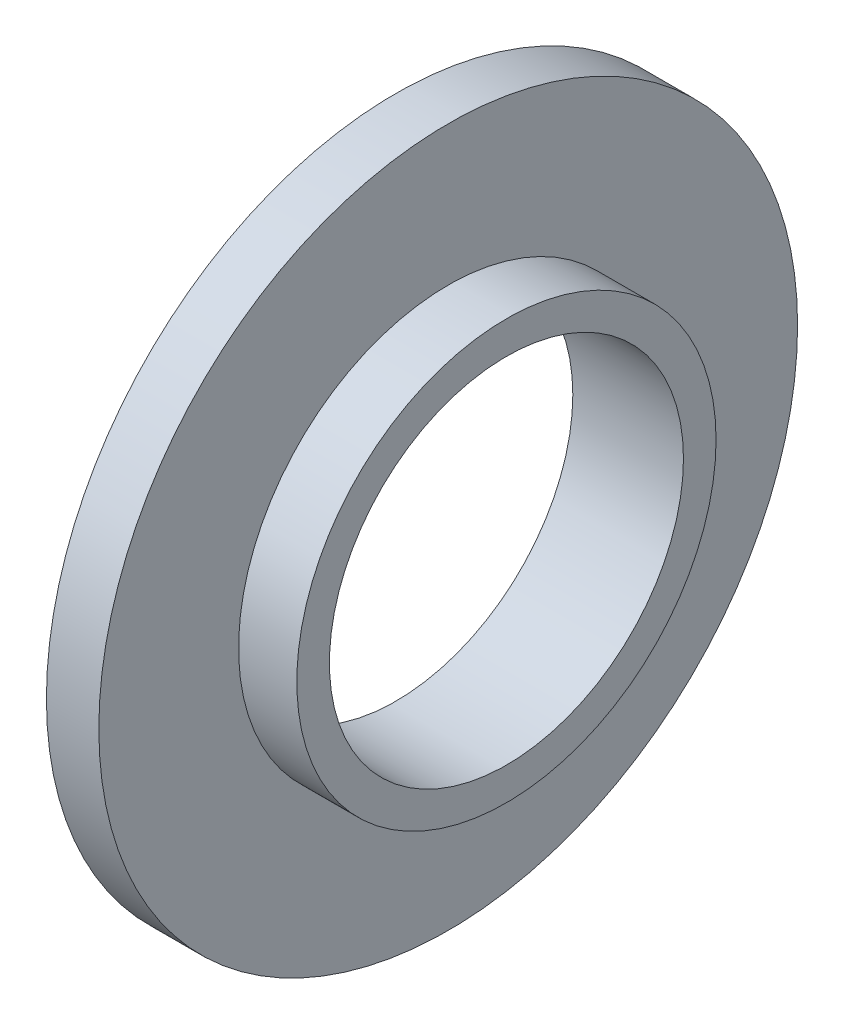
ISO-10303-21;
HEADER;
FILE_DESCRIPTION(('STEP AP214'),'2;1');
FILE_NAME('part.step','',(''),(''),'','','');
FILE_SCHEMA(('AUTOMOTIVE_DESIGN { 1 0 10303 214 1 1 1 1 }'));
ENDSEC;
DATA;
#1=APPLICATION_CONTEXT('core data for automotive mechanical design processes');
#2=APPLICATION_PROTOCOL_DEFINITION('international standard','automotive_design',2000,#1);
#3=PRODUCT_CONTEXT('',#1,'mechanical');
#4=PRODUCT('Part','Part','',(#3));
#5=PRODUCT_RELATED_PRODUCT_CATEGORY('part','',(#4));
#6=PRODUCT_DEFINITION_FORMATION('','',#4);
#7=PRODUCT_DEFINITION_CONTEXT('part definition',#1,'design');
#8=PRODUCT_DEFINITION('design','',#6,#7);
#9=PRODUCT_DEFINITION_SHAPE('','',#8);
#10=(LENGTH_UNIT() NAMED_UNIT(*) SI_UNIT(.MILLI.,.METRE.));
#11=(NAMED_UNIT(*) PLANE_ANGLE_UNIT() SI_UNIT($,.RADIAN.));
#12=(NAMED_UNIT(*) SI_UNIT($,.STERADIAN.) SOLID_ANGLE_UNIT());
#13=UNCERTAINTY_MEASURE_WITH_UNIT(LENGTH_MEASURE(1.E-05),#10,'distance_accuracy_value','');
#14=(GEOMETRIC_REPRESENTATION_CONTEXT(3) GLOBAL_UNCERTAINTY_ASSIGNED_CONTEXT((#13)) GLOBAL_UNIT_ASSIGNED_CONTEXT((#10,
#11,#12)) REPRESENTATION_CONTEXT('',''));
#15=CARTESIAN_POINT('',(0.,0.,0.));
#16=DIRECTION('',(0.,0.,1.));
#17=DIRECTION('',(1.,0.,0.));
#18=AXIS2_PLACEMENT_3D('',#15,#16,#17);
#19=CARTESIAN_POINT('',(4.5,0.,0.));
#20=DIRECTION('',(1.,0.,0.));
#21=DIRECTION('',(0.,0.,-1.));
#22=AXIS2_PLACEMENT_3D('',#19,#20,#21);
#23=PLANE('',#22);
#24=CARTESIAN_POINT('',(4.5,0.,0.));
#25=DIRECTION('',(1.,0.,0.));
#26=DIRECTION('',(0.,0.,-1.));
#27=AXIS2_PLACEMENT_3D('',#24,#25,#26);
#28=CIRCLE('',#27,30.);
#29=CARTESIAN_POINT('',(4.5,0.,-30.));
#30=VERTEX_POINT('',#29);
#31=EDGE_CURVE('E10',#30,#30,#28,.T.);
#32=ORIENTED_EDGE('',*,*,#31,.T.);
#33=EDGE_LOOP('',(#32));
#34=FACE_BOUND('',#33,.T.);
#35=CARTESIAN_POINT('',(4.5,0.,0.));
#36=DIRECTION('',(1.,0.,0.));
#37=DIRECTION('',(0.,0.,-1.));
#38=AXIS2_PLACEMENT_3D('',#35,#36,#37);
#39=CIRCLE('',#38,18.);
#40=CARTESIAN_POINT('',(4.5,0.,-18.));
#41=VERTEX_POINT('',#40);
#42=EDGE_CURVE('E42',#41,#41,#39,.T.);
#43=ORIENTED_EDGE('',*,*,#42,.F.);
#44=EDGE_LOOP('',(#43));
#45=FACE_BOUND('',#44,.T.);
#46=ADVANCED_FACE('F29',(#34,#45),#23,.T.);
#47=CARTESIAN_POINT('',(4.5,0.,0.));
#48=DIRECTION('',(-1.,0.,0.));
#49=DIRECTION('',(0.,0.,1.));
#50=AXIS2_PLACEMENT_3D('',#47,#48,#49);
#51=CYLINDRICAL_SURFACE('',#50,30.);
#52=ORIENTED_EDGE('',*,*,#31,.F.);
#53=EDGE_LOOP('',(#52));
#54=FACE_BOUND('',#53,.T.);
#55=CARTESIAN_POINT('',(0.,0.,0.));
#56=DIRECTION('',(1.,0.,0.));
#57=DIRECTION('',(0.,0.,-1.));
#58=AXIS2_PLACEMENT_3D('',#55,#56,#57);
#59=CIRCLE('',#58,30.);
#60=CARTESIAN_POINT('',(0.,0.,-30.));
#61=VERTEX_POINT('',#60);
#62=EDGE_CURVE('E33',#61,#61,#59,.T.);
#63=ORIENTED_EDGE('',*,*,#62,.T.);
#64=EDGE_LOOP('',(#63));
#65=FACE_BOUND('',#64,.T.);
#66=ADVANCED_FACE('F31',(#54,#65),#51,.T.);
#67=CARTESIAN_POINT('',(0.,0.,0.));
#68=DIRECTION('',(1.,0.,0.));
#69=DIRECTION('',(0.,0.,-1.));
#70=AXIS2_PLACEMENT_3D('',#67,#68,#69);
#71=PLANE('',#70);
#72=CARTESIAN_POINT('',(0.,0.,0.));
#73=DIRECTION('',(1.,0.,0.));
#74=DIRECTION('',(0.,0.,-1.));
#75=AXIS2_PLACEMENT_3D('',#72,#73,#74);
#76=CIRCLE('',#75,15.2);
#77=CARTESIAN_POINT('',(0.,0.,-15.2));
#78=VERTEX_POINT('',#77);
#79=EDGE_CURVE('E45',#78,#78,#76,.T.);
#80=ORIENTED_EDGE('',*,*,#79,.T.);
#81=EDGE_LOOP('',(#80));
#82=FACE_BOUND('',#81,.T.);
#83=ORIENTED_EDGE('',*,*,#62,.F.);
#84=EDGE_LOOP('',(#83));
#85=FACE_BOUND('',#84,.T.);
#86=ADVANCED_FACE('F54',(#82,#85),#71,.F.);
#87=CARTESIAN_POINT('',(9.5,0.,0.));
#88=DIRECTION('',(-1.,0.,0.));
#89=DIRECTION('',(0.,0.,1.));
#90=AXIS2_PLACEMENT_3D('',#87,#88,#89);
#91=CYLINDRICAL_SURFACE('',#90,18.);
#92=CARTESIAN_POINT('',(9.5,0.,0.));
#93=DIRECTION('',(1.,0.,0.));
#94=DIRECTION('',(0.,0.,-1.));
#95=AXIS2_PLACEMENT_3D('',#92,#93,#94);
#96=CIRCLE('',#95,18.);
#97=CARTESIAN_POINT('',(9.5,0.,-18.));
#98=VERTEX_POINT('',#97);
#99=EDGE_CURVE('E40',#98,#98,#96,.T.);
#100=ORIENTED_EDGE('',*,*,#99,.F.);
#101=EDGE_LOOP('',(#100));
#102=FACE_BOUND('',#101,.T.);
#103=ORIENTED_EDGE('',*,*,#42,.T.);
#104=EDGE_LOOP('',(#103));
#105=FACE_BOUND('',#104,.T.);
#106=ADVANCED_FACE('F66',(#102,#105),#91,.T.);
#107=CARTESIAN_POINT('',(9.5,0.,0.));
#108=DIRECTION('',(1.,0.,0.));
#109=DIRECTION('',(0.,0.,-1.));
#110=AXIS2_PLACEMENT_3D('',#107,#108,#109);
#111=PLANE('',#110);
#112=CARTESIAN_POINT('',(9.5,0.,0.));
#113=DIRECTION('',(1.,0.,0.));
#114=DIRECTION('',(0.,0.,-1.));
#115=AXIS2_PLACEMENT_3D('',#112,#113,#114);
#116=CIRCLE('',#115,15.2);
#117=CARTESIAN_POINT('',(9.5,0.,-15.2));
#118=VERTEX_POINT('',#117);
#119=EDGE_CURVE('E48',#118,#118,#116,.T.);
#120=ORIENTED_EDGE('',*,*,#119,.F.);
#121=EDGE_LOOP('',(#120));
#122=FACE_BOUND('',#121,.T.);
#123=ORIENTED_EDGE('',*,*,#99,.T.);
#124=EDGE_LOOP('',(#123));
#125=FACE_BOUND('',#124,.T.);
#126=ADVANCED_FACE('F60',(#122,#125),#111,.T.);
#127=CARTESIAN_POINT('',(0.,0.,0.));
#128=DIRECTION('',(1.,0.,0.));
#129=DIRECTION('',(0.,0.,-1.));
#130=AXIS2_PLACEMENT_3D('',#127,#128,#129);
#131=CYLINDRICAL_SURFACE('',#130,15.2);
#132=ORIENTED_EDGE('',*,*,#79,.F.);
#133=EDGE_LOOP('',(#132));
#134=FACE_BOUND('',#133,.T.);
#135=ORIENTED_EDGE('',*,*,#119,.T.);
#136=EDGE_LOOP('',(#135));
#137=FACE_BOUND('',#136,.T.);
#138=ADVANCED_FACE('F57',(#134,#137),#131,.F.);
#139=CLOSED_SHELL('',(#46,#66,#86,#106,#126,#138));
#140=MANIFOLD_SOLID_BREP('B2',#139);
#141=ADVANCED_BREP_SHAPE_REPRESENTATION('',(#18,#140),#14);
#142=SHAPE_DEFINITION_REPRESENTATION(#9,#141);
ENDSEC;
END-ISO-10303-21;
